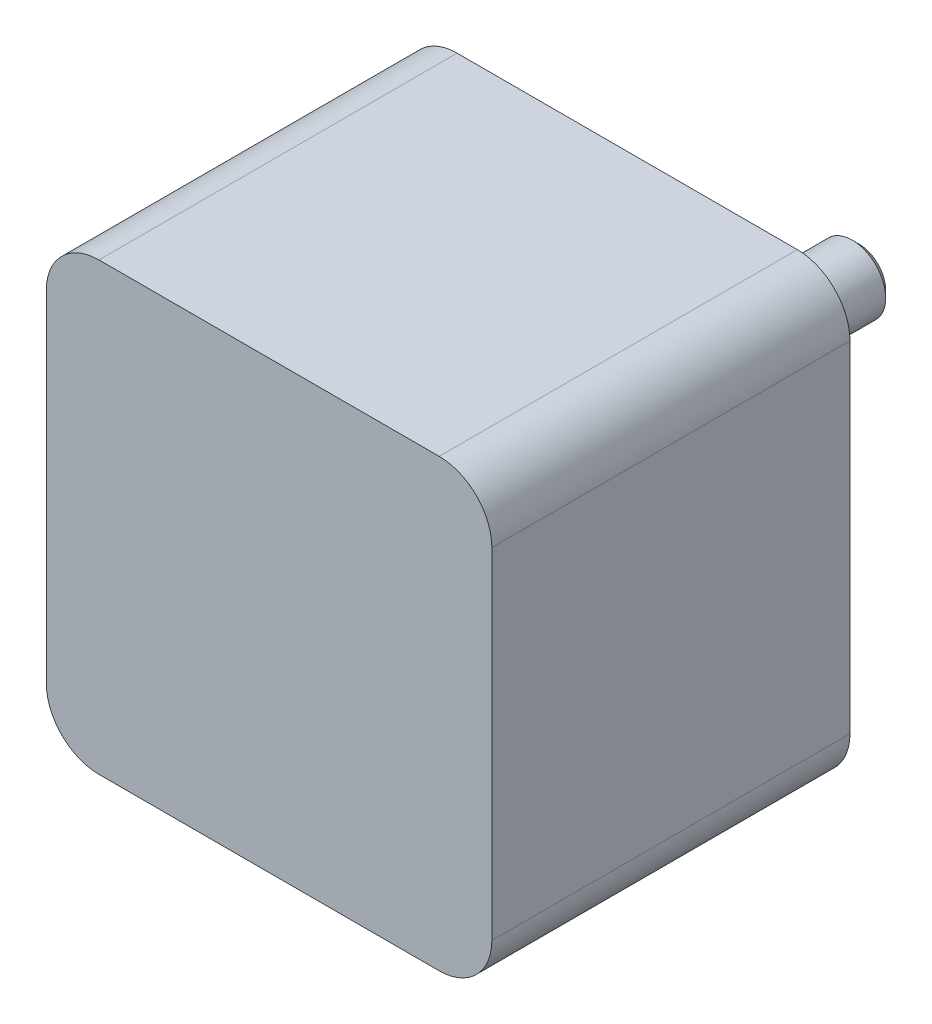
ISO-10303-21;
HEADER;
FILE_DESCRIPTION(('STEP AP214'),'2;1');
FILE_NAME('part.step','',(''),(''),'','','');
FILE_SCHEMA(('AUTOMOTIVE_DESIGN { 1 0 10303 214 1 1 1 1 }'));
ENDSEC;
DATA;
#1=APPLICATION_CONTEXT('core data for automotive mechanical design processes');
#2=APPLICATION_PROTOCOL_DEFINITION('international standard','automotive_design',2000,#1);
#3=PRODUCT_CONTEXT('',#1,'mechanical');
#4=PRODUCT('Part','Part','',(#3));
#5=PRODUCT_RELATED_PRODUCT_CATEGORY('part','',(#4));
#6=PRODUCT_DEFINITION_FORMATION('','',#4);
#7=PRODUCT_DEFINITION_CONTEXT('part definition',#1,'design');
#8=PRODUCT_DEFINITION('design','',#6,#7);
#9=PRODUCT_DEFINITION_SHAPE('','',#8);
#10=(LENGTH_UNIT() NAMED_UNIT(*) SI_UNIT(.MILLI.,.METRE.));
#11=(NAMED_UNIT(*) PLANE_ANGLE_UNIT() SI_UNIT($,.RADIAN.));
#12=(NAMED_UNIT(*) SI_UNIT($,.STERADIAN.) SOLID_ANGLE_UNIT());
#13=UNCERTAINTY_MEASURE_WITH_UNIT(LENGTH_MEASURE(1.E-05),#10,'distance_accuracy_value','');
#14=(GEOMETRIC_REPRESENTATION_CONTEXT(3) GLOBAL_UNCERTAINTY_ASSIGNED_CONTEXT((#13)) GLOBAL_UNIT_ASSIGNED_CONTEXT((#10,
#11,#12)) REPRESENTATION_CONTEXT('',''));
#15=CARTESIAN_POINT('',(0.,0.,0.));
#16=DIRECTION('',(0.,0.,1.));
#17=DIRECTION('',(1.,0.,0.));
#18=AXIS2_PLACEMENT_3D('',#15,#16,#17);
#19=CARTESIAN_POINT('',(0.,0.,-2.));
#20=DIRECTION('',(0.,0.,-1.));
#21=DIRECTION('',(-1.,0.,0.));
#22=AXIS2_PLACEMENT_3D('',#19,#20,#21);
#23=PLANE('',#22);
#24=CARTESIAN_POINT('',(0.,0.,-2.));
#25=DIRECTION('',(0.,0.,-1.));
#26=DIRECTION('',(-1.,0.,0.));
#27=AXIS2_PLACEMENT_3D('',#24,#25,#26);
#28=CIRCLE('',#27,11.);
#29=CARTESIAN_POINT('',(-11.,0.,-2.));
#30=VERTEX_POINT('',#29);
#31=EDGE_CURVE('E124',#30,#30,#28,.T.);
#32=ORIENTED_EDGE('',*,*,#31,.T.);
#33=EDGE_LOOP('',(#32));
#34=FACE_BOUND('',#33,.T.);
#35=CARTESIAN_POINT('',(0.,0.,-2.));
#36=DIRECTION('',(0.,0.,-1.));
#37=DIRECTION('',(-1.,0.,0.));
#38=AXIS2_PLACEMENT_3D('',#35,#36,#37);
#39=CIRCLE('',#38,3.175);
#40=CARTESIAN_POINT('',(-3.175,0.,-2.));
#41=VERTEX_POINT('',#40);
#42=EDGE_CURVE('E290',#41,#41,#39,.T.);
#43=ORIENTED_EDGE('',*,*,#42,.F.);
#44=EDGE_LOOP('',(#43));
#45=FACE_BOUND('',#44,.T.);
#46=ADVANCED_FACE('F31',(#34,#45),#23,.T.);
#47=CARTESIAN_POINT('',(-16.15,-16.15,0.));
#48=DIRECTION('',(0.,0.,-1.));
#49=DIRECTION('',(-1.,0.,0.));
#50=AXIS2_PLACEMENT_3D('',#47,#48,#49);
#51=PLANE('',#50);
#52=CARTESIAN_POINT('',(-15.4999999999997,-15.5000000000002,0.));
#53=DIRECTION('',(0.,0.,1.));
#54=DIRECTION('',(1.,0.,0.));
#55=AXIS2_PLACEMENT_3D('',#52,#53,#54);
#56=CIRCLE('',#55,1.5875);
#57=CARTESIAN_POINT('',(-13.9124999999997,-15.5000000000002,0.));
#58=VERTEX_POINT('',#57);
#59=EDGE_CURVE('E156',#58,#58,#56,.T.);
#60=ORIENTED_EDGE('',*,*,#59,.T.);
#61=EDGE_LOOP('',(#60));
#62=FACE_BOUND('',#61,.T.);
#63=CARTESIAN_POINT('',(-15.5,15.4999999999998,0.));
#64=DIRECTION('',(0.,0.,1.));
#65=DIRECTION('',(1.,0.,0.));
#66=AXIS2_PLACEMENT_3D('',#63,#64,#65);
#67=CIRCLE('',#66,1.5875);
#68=CARTESIAN_POINT('',(-13.9125,15.4999999999998,0.));
#69=VERTEX_POINT('',#68);
#70=EDGE_CURVE('E162',#69,#69,#67,.T.);
#71=ORIENTED_EDGE('',*,*,#70,.T.);
#72=EDGE_LOOP('',(#71));
#73=FACE_BOUND('',#72,.T.);
#74=CARTESIAN_POINT('',(-16.15,-16.15,0.));
#75=DIRECTION('',(0.,0.,1.));
#76=DIRECTION('',(-1.,0.,0.));
#77=AXIS2_PLACEMENT_3D('',#74,#75,#76);
#78=CIRCLE('',#77,5.);
#79=CARTESIAN_POINT('',(-21.15,-16.15,0.));
#80=VERTEX_POINT('',#79);
#81=CARTESIAN_POINT('',(-16.15,-21.15,0.));
#82=VERTEX_POINT('',#81);
#83=EDGE_CURVE('E168',#80,#82,#78,.T.);
#84=ORIENTED_EDGE('',*,*,#83,.F.);
#85=DIRECTION('',(0.,-1.,0.));
#86=VECTOR('',#85,1.);
#87=CARTESIAN_POINT('',(-21.15,-16.15,0.));
#88=LINE('',#87,#86);
#89=CARTESIAN_POINT('',(-21.15,16.15,0.));
#90=VERTEX_POINT('',#89);
#91=EDGE_CURVE('E46',#90,#80,#88,.T.);
#92=ORIENTED_EDGE('',*,*,#91,.F.);
#93=CARTESIAN_POINT('',(-16.15,16.15,0.));
#94=DIRECTION('',(0.,0.,1.));
#95=DIRECTION('',(-1.,0.,0.));
#96=AXIS2_PLACEMENT_3D('',#93,#94,#95);
#97=CIRCLE('',#96,5.);
#98=CARTESIAN_POINT('',(-16.15,21.15,0.));
#99=VERTEX_POINT('',#98);
#100=EDGE_CURVE('E54',#99,#90,#97,.T.);
#101=ORIENTED_EDGE('',*,*,#100,.F.);
#102=DIRECTION('',(-1.,0.,0.));
#103=VECTOR('',#102,1.);
#104=CARTESIAN_POINT('',(-16.15,21.15,0.));
#105=LINE('',#104,#103);
#106=CARTESIAN_POINT('',(16.15,21.15,0.));
#107=VERTEX_POINT('',#106);
#108=EDGE_CURVE('E178',#107,#99,#105,.T.);
#109=ORIENTED_EDGE('',*,*,#108,.F.);
#110=CARTESIAN_POINT('',(16.15,16.15,0.));
#111=DIRECTION('',(0.,0.,1.));
#112=DIRECTION('',(-1.,0.,0.));
#113=AXIS2_PLACEMENT_3D('',#110,#111,#112);
#114=CIRCLE('',#113,5.);
#115=CARTESIAN_POINT('',(21.15,16.15,0.));
#116=VERTEX_POINT('',#115);
#117=EDGE_CURVE('E176',#116,#107,#114,.T.);
#118=ORIENTED_EDGE('',*,*,#117,.F.);
#119=DIRECTION('',(0.,1.,0.));
#120=VECTOR('',#119,1.);
#121=CARTESIAN_POINT('',(21.15,-16.15,0.));
#122=LINE('',#121,#120);
#123=CARTESIAN_POINT('',(21.15,-16.15,0.));
#124=VERTEX_POINT('',#123);
#125=EDGE_CURVE('E174',#124,#116,#122,.T.);
#126=ORIENTED_EDGE('',*,*,#125,.F.);
#127=CARTESIAN_POINT('',(16.15,-16.15,0.));
#128=DIRECTION('',(0.,0.,1.));
#129=DIRECTION('',(1.,0.,0.));
#130=AXIS2_PLACEMENT_3D('',#127,#128,#129);
#131=CIRCLE('',#130,5.);
#132=CARTESIAN_POINT('',(16.15,-21.15,0.));
#133=VERTEX_POINT('',#132);
#134=EDGE_CURVE('E104',#133,#124,#131,.T.);
#135=ORIENTED_EDGE('',*,*,#134,.F.);
#136=DIRECTION('',(1.,0.,0.));
#137=VECTOR('',#136,1.);
#138=CARTESIAN_POINT('',(-16.15,-21.15,0.));
#139=LINE('',#138,#137);
#140=EDGE_CURVE('E171',#82,#133,#139,.T.);
#141=ORIENTED_EDGE('',*,*,#140,.F.);
#142=EDGE_LOOP('',(#84,#92,#101,#109,#118,#126,#135,#141));
#143=FACE_BOUND('',#142,.T.);
#144=CARTESIAN_POINT('',(15.5,15.5,0.));
#145=DIRECTION('',(0.,0.,1.));
#146=DIRECTION('',(1.,0.,0.));
#147=AXIS2_PLACEMENT_3D('',#144,#145,#146);
#148=CIRCLE('',#147,1.5875);
#149=CARTESIAN_POINT('',(17.0875,15.5,0.));
#150=VERTEX_POINT('',#149);
#151=EDGE_CURVE('E165',#150,#150,#148,.T.);
#152=ORIENTED_EDGE('',*,*,#151,.T.);
#153=EDGE_LOOP('',(#152));
#154=FACE_BOUND('',#153,.T.);
#155=CARTESIAN_POINT('',(15.5000000000003,-15.5,0.));
#156=DIRECTION('',(0.,0.,1.));
#157=DIRECTION('',(1.,0.,0.));
#158=AXIS2_PLACEMENT_3D('',#155,#156,#157);
#159=CIRCLE('',#158,1.5875);
#160=CARTESIAN_POINT('',(17.0875000000003,-15.5,0.));
#161=VERTEX_POINT('',#160);
#162=EDGE_CURVE('E159',#161,#161,#159,.T.);
#163=ORIENTED_EDGE('',*,*,#162,.T.);
#164=EDGE_LOOP('',(#163));
#165=FACE_BOUND('',#164,.T.);
#166=CARTESIAN_POINT('',(0.,0.,0.));
#167=DIRECTION('',(0.,0.,-1.));
#168=DIRECTION('',(-1.,0.,0.));
#169=AXIS2_PLACEMENT_3D('',#166,#167,#168);
#170=CIRCLE('',#169,11.);
#171=CARTESIAN_POINT('',(-11.,0.,0.));
#172=VERTEX_POINT('',#171);
#173=EDGE_CURVE('E127',#172,#172,#170,.T.);
#174=ORIENTED_EDGE('',*,*,#173,.F.);
#175=EDGE_LOOP('',(#174));
#176=FACE_BOUND('',#175,.T.);
#177=ADVANCED_FACE('F209',(#62,#73,#143,#154,#165,#176),#51,.T.);
#178=CARTESIAN_POINT('',(-16.15,-16.15,32.));
#179=DIRECTION('',(0.,0.,-1.));
#180=DIRECTION('',(-1.,0.,0.));
#181=AXIS2_PLACEMENT_3D('',#178,#179,#180);
#182=CYLINDRICAL_SURFACE('',#181,5.);
#183=ORIENTED_EDGE('',*,*,#83,.T.);
#184=DIRECTION('',(0.,0.,-1.));
#185=VECTOR('',#184,1.);
#186=CARTESIAN_POINT('',(-16.15,-21.15,32.));
#187=LINE('',#186,#185);
#188=CARTESIAN_POINT('',(-16.15,-21.15,34.));
#189=VERTEX_POINT('',#188);
#190=EDGE_CURVE('E193',#189,#82,#187,.T.);
#191=ORIENTED_EDGE('',*,*,#190,.F.);
#192=CARTESIAN_POINT('',(-16.15,-16.15,34.));
#193=DIRECTION('',(0.,0.,1.));
#194=DIRECTION('',(-1.,0.,0.));
#195=AXIS2_PLACEMENT_3D('',#192,#193,#194);
#196=CIRCLE('',#195,5.);
#197=CARTESIAN_POINT('',(-21.15,-16.15,34.));
#198=VERTEX_POINT('',#197);
#199=EDGE_CURVE('E141',#198,#189,#196,.T.);
#200=ORIENTED_EDGE('',*,*,#199,.F.);
#201=DIRECTION('',(0.,0.,-1.));
#202=VECTOR('',#201,1.);
#203=CARTESIAN_POINT('',(-21.15,-16.15,32.));
#204=LINE('',#203,#202);
#205=EDGE_CURVE('E182',#198,#80,#204,.T.);
#206=ORIENTED_EDGE('',*,*,#205,.T.);
#207=EDGE_LOOP('',(#183,#191,#200,#206));
#208=FACE_BOUND('',#207,.T.);
#209=ADVANCED_FACE('F215',(#208),#182,.T.);
#210=CARTESIAN_POINT('',(-16.15,-21.15,32.));
#211=DIRECTION('',(0.,1.,0.));
#212=DIRECTION('',(0.,0.,1.));
#213=AXIS2_PLACEMENT_3D('',#210,#211,#212);
#214=PLANE('',#213);
#215=ORIENTED_EDGE('',*,*,#140,.T.);
#216=DIRECTION('',(0.,0.,-1.));
#217=VECTOR('',#216,1.);
#218=CARTESIAN_POINT('',(16.15,-21.15,32.));
#219=LINE('',#218,#217);
#220=CARTESIAN_POINT('',(16.15,-21.15,34.));
#221=VERTEX_POINT('',#220);
#222=EDGE_CURVE('E107',#221,#133,#219,.T.);
#223=ORIENTED_EDGE('',*,*,#222,.F.);
#224=DIRECTION('',(1.,0.,0.));
#225=VECTOR('',#224,1.);
#226=CARTESIAN_POINT('',(-16.15,-21.15,34.));
#227=LINE('',#226,#225);
#228=EDGE_CURVE('E123',#189,#221,#227,.T.);
#229=ORIENTED_EDGE('',*,*,#228,.F.);
#230=ORIENTED_EDGE('',*,*,#190,.T.);
#231=EDGE_LOOP('',(#215,#223,#229,#230));
#232=FACE_BOUND('',#231,.T.);
#233=ADVANCED_FACE('F267',(#232),#214,.F.);
#234=CARTESIAN_POINT('',(16.15,-16.15,32.));
#235=DIRECTION('',(0.,0.,-1.));
#236=DIRECTION('',(-1.,0.,0.));
#237=AXIS2_PLACEMENT_3D('',#234,#235,#236);
#238=CYLINDRICAL_SURFACE('',#237,5.);
#239=ORIENTED_EDGE('',*,*,#134,.T.);
#240=DIRECTION('',(0.,0.,-1.));
#241=VECTOR('',#240,1.);
#242=CARTESIAN_POINT('',(21.15,-16.15,32.));
#243=LINE('',#242,#241);
#244=CARTESIAN_POINT('',(21.15,-16.15,34.));
#245=VERTEX_POINT('',#244);
#246=EDGE_CURVE('E97',#245,#124,#243,.T.);
#247=ORIENTED_EDGE('',*,*,#246,.F.);
#248=CARTESIAN_POINT('',(16.15,-16.15,34.));
#249=DIRECTION('',(0.,0.,1.));
#250=DIRECTION('',(1.,0.,0.));
#251=AXIS2_PLACEMENT_3D('',#248,#249,#250);
#252=CIRCLE('',#251,5.);
#253=EDGE_CURVE('E102',#221,#245,#252,.T.);
#254=ORIENTED_EDGE('',*,*,#253,.F.);
#255=ORIENTED_EDGE('',*,*,#222,.T.);
#256=EDGE_LOOP('',(#239,#247,#254,#255));
#257=FACE_BOUND('',#256,.T.);
#258=ADVANCED_FACE('F99',(#257),#238,.T.);
#259=CARTESIAN_POINT('',(21.15,-16.15,32.));
#260=DIRECTION('',(-1.,0.,0.));
#261=DIRECTION('',(0.,0.,1.));
#262=AXIS2_PLACEMENT_3D('',#259,#260,#261);
#263=PLANE('',#262);
#264=ORIENTED_EDGE('',*,*,#125,.T.);
#265=DIRECTION('',(0.,0.,-1.));
#266=VECTOR('',#265,1.);
#267=CARTESIAN_POINT('',(21.15,16.15,32.));
#268=LINE('',#267,#266);
#269=CARTESIAN_POINT('',(21.15,16.15,34.));
#270=VERTEX_POINT('',#269);
#271=EDGE_CURVE('E108',#270,#116,#268,.T.);
#272=ORIENTED_EDGE('',*,*,#271,.F.);
#273=DIRECTION('',(0.,1.,0.));
#274=VECTOR('',#273,1.);
#275=CARTESIAN_POINT('',(21.15,-16.15,34.));
#276=LINE('',#275,#274);
#277=EDGE_CURVE('E111',#245,#270,#276,.T.);
#278=ORIENTED_EDGE('',*,*,#277,.F.);
#279=ORIENTED_EDGE('',*,*,#246,.T.);
#280=EDGE_LOOP('',(#264,#272,#278,#279));
#281=FACE_BOUND('',#280,.T.);
#282=ADVANCED_FACE('F112',(#281),#263,.F.);
#283=CARTESIAN_POINT('',(16.15,16.15,32.));
#284=DIRECTION('',(0.,0.,-1.));
#285=DIRECTION('',(-1.,0.,0.));
#286=AXIS2_PLACEMENT_3D('',#283,#284,#285);
#287=CYLINDRICAL_SURFACE('',#286,5.);
#288=ORIENTED_EDGE('',*,*,#117,.T.);
#289=DIRECTION('',(0.,0.,-1.));
#290=VECTOR('',#289,1.);
#291=CARTESIAN_POINT('',(16.15,21.15,32.));
#292=LINE('',#291,#290);
#293=CARTESIAN_POINT('',(16.15,21.15,34.));
#294=VERTEX_POINT('',#293);
#295=EDGE_CURVE('E188',#294,#107,#292,.T.);
#296=ORIENTED_EDGE('',*,*,#295,.F.);
#297=CARTESIAN_POINT('',(16.15,16.15,34.));
#298=DIRECTION('',(0.,0.,1.));
#299=DIRECTION('',(-1.,0.,0.));
#300=AXIS2_PLACEMENT_3D('',#297,#298,#299);
#301=CIRCLE('',#300,5.);
#302=EDGE_CURVE('E117',#270,#294,#301,.T.);
#303=ORIENTED_EDGE('',*,*,#302,.F.);
#304=ORIENTED_EDGE('',*,*,#271,.T.);
#305=EDGE_LOOP('',(#288,#296,#303,#304));
#306=FACE_BOUND('',#305,.T.);
#307=ADVANCED_FACE('F258',(#306),#287,.T.);
#308=CARTESIAN_POINT('',(-16.15,21.15,32.));
#309=DIRECTION('',(0.,-1.,0.));
#310=DIRECTION('',(0.,0.,-1.));
#311=AXIS2_PLACEMENT_3D('',#308,#309,#310);
#312=PLANE('',#311);
#313=ORIENTED_EDGE('',*,*,#108,.T.);
#314=DIRECTION('',(0.,0.,-1.));
#315=VECTOR('',#314,1.);
#316=CARTESIAN_POINT('',(-16.15,21.15,32.));
#317=LINE('',#316,#315);
#318=CARTESIAN_POINT('',(-16.15,21.15,34.));
#319=VERTEX_POINT('',#318);
#320=EDGE_CURVE('E186',#319,#99,#317,.T.);
#321=ORIENTED_EDGE('',*,*,#320,.F.);
#322=DIRECTION('',(-1.,0.,0.));
#323=VECTOR('',#322,1.);
#324=CARTESIAN_POINT('',(-16.15,21.15,34.));
#325=LINE('',#324,#323);
#326=EDGE_CURVE('E132',#294,#319,#325,.T.);
#327=ORIENTED_EDGE('',*,*,#326,.F.);
#328=ORIENTED_EDGE('',*,*,#295,.T.);
#329=EDGE_LOOP('',(#313,#321,#327,#328));
#330=FACE_BOUND('',#329,.T.);
#331=ADVANCED_FACE('F255',(#330),#312,.F.);
#332=CARTESIAN_POINT('',(-16.15,16.15,32.));
#333=DIRECTION('',(0.,0.,-1.));
#334=DIRECTION('',(-1.,0.,0.));
#335=AXIS2_PLACEMENT_3D('',#332,#333,#334);
#336=CYLINDRICAL_SURFACE('',#335,5.);
#337=ORIENTED_EDGE('',*,*,#100,.T.);
#338=DIRECTION('',(0.,0.,-1.));
#339=VECTOR('',#338,1.);
#340=CARTESIAN_POINT('',(-21.15,16.15,32.));
#341=LINE('',#340,#339);
#342=CARTESIAN_POINT('',(-21.15,16.15,34.));
#343=VERTEX_POINT('',#342);
#344=EDGE_CURVE('E184',#343,#90,#341,.T.);
#345=ORIENTED_EDGE('',*,*,#344,.F.);
#346=CARTESIAN_POINT('',(-16.15,16.15,34.));
#347=DIRECTION('',(0.,0.,1.));
#348=DIRECTION('',(-1.,0.,0.));
#349=AXIS2_PLACEMENT_3D('',#346,#347,#348);
#350=CIRCLE('',#349,5.);
#351=EDGE_CURVE('E135',#319,#343,#350,.T.);
#352=ORIENTED_EDGE('',*,*,#351,.F.);
#353=ORIENTED_EDGE('',*,*,#320,.T.);
#354=EDGE_LOOP('',(#337,#345,#352,#353));
#355=FACE_BOUND('',#354,.T.);
#356=ADVANCED_FACE('F252',(#355),#336,.T.);
#357=CARTESIAN_POINT('',(-21.15,-16.15,32.));
#358=DIRECTION('',(1.,0.,0.));
#359=DIRECTION('',(0.,0.,-1.));
#360=AXIS2_PLACEMENT_3D('',#357,#358,#359);
#361=PLANE('',#360);
#362=ORIENTED_EDGE('',*,*,#91,.T.);
#363=ORIENTED_EDGE('',*,*,#205,.F.);
#364=DIRECTION('',(0.,-1.,0.));
#365=VECTOR('',#364,1.);
#366=CARTESIAN_POINT('',(-21.15,-16.15,34.));
#367=LINE('',#366,#365);
#368=EDGE_CURVE('E138',#343,#198,#367,.T.);
#369=ORIENTED_EDGE('',*,*,#368,.F.);
#370=ORIENTED_EDGE('',*,*,#344,.T.);
#371=EDGE_LOOP('',(#362,#363,#369,#370));
#372=FACE_BOUND('',#371,.T.);
#373=ADVANCED_FACE('F247',(#372),#361,.F.);
#374=CARTESIAN_POINT('',(15.5,15.5,32.));
#375=DIRECTION('',(0.,0.,-1.));
#376=DIRECTION('',(-1.,0.,0.));
#377=AXIS2_PLACEMENT_3D('',#374,#375,#376);
#378=CYLINDRICAL_SURFACE('',#377,1.5875);
#379=CARTESIAN_POINT('',(15.5,15.5,32.));
#380=DIRECTION('',(0.,0.,1.));
#381=DIRECTION('',(1.,0.,0.));
#382=AXIS2_PLACEMENT_3D('',#379,#380,#381);
#383=CIRCLE('',#382,1.5875);
#384=CARTESIAN_POINT('',(17.0875,15.5,32.));
#385=VERTEX_POINT('',#384);
#386=EDGE_CURVE('E153',#385,#385,#383,.T.);
#387=ORIENTED_EDGE('',*,*,#386,.T.);
#388=EDGE_LOOP('',(#387));
#389=FACE_BOUND('',#388,.T.);
#390=ORIENTED_EDGE('',*,*,#151,.F.);
#391=EDGE_LOOP('',(#390));
#392=FACE_BOUND('',#391,.T.);
#393=ADVANCED_FACE('F244',(#389,#392),#378,.F.);
#394=CARTESIAN_POINT('',(-15.5,15.4999999999998,32.));
#395=DIRECTION('',(0.,0.,-1.));
#396=DIRECTION('',(-1.,0.,0.));
#397=AXIS2_PLACEMENT_3D('',#394,#395,#396);
#398=CYLINDRICAL_SURFACE('',#397,1.5875);
#399=CARTESIAN_POINT('',(-15.5,15.4999999999998,32.));
#400=DIRECTION('',(0.,0.,1.));
#401=DIRECTION('',(1.,0.,0.));
#402=AXIS2_PLACEMENT_3D('',#399,#400,#401);
#403=CIRCLE('',#402,1.5875);
#404=CARTESIAN_POINT('',(-13.9125,15.4999999999998,32.));
#405=VERTEX_POINT('',#404);
#406=EDGE_CURVE('E150',#405,#405,#403,.T.);
#407=ORIENTED_EDGE('',*,*,#406,.T.);
#408=EDGE_LOOP('',(#407));
#409=FACE_BOUND('',#408,.T.);
#410=ORIENTED_EDGE('',*,*,#70,.F.);
#411=EDGE_LOOP('',(#410));
#412=FACE_BOUND('',#411,.T.);
#413=ADVANCED_FACE('F240',(#409,#412),#398,.F.);
#414=CARTESIAN_POINT('',(15.5000000000003,-15.5,32.));
#415=DIRECTION('',(0.,0.,-1.));
#416=DIRECTION('',(-1.,0.,0.));
#417=AXIS2_PLACEMENT_3D('',#414,#415,#416);
#418=CYLINDRICAL_SURFACE('',#417,1.5875);
#419=CARTESIAN_POINT('',(15.5000000000003,-15.5,32.));
#420=DIRECTION('',(0.,0.,1.));
#421=DIRECTION('',(1.,0.,0.));
#422=AXIS2_PLACEMENT_3D('',#419,#420,#421);
#423=CIRCLE('',#422,1.5875);
#424=CARTESIAN_POINT('',(17.0875000000003,-15.5,32.));
#425=VERTEX_POINT('',#424);
#426=EDGE_CURVE('E147',#425,#425,#423,.T.);
#427=ORIENTED_EDGE('',*,*,#426,.T.);
#428=EDGE_LOOP('',(#427));
#429=FACE_BOUND('',#428,.T.);
#430=ORIENTED_EDGE('',*,*,#162,.F.);
#431=EDGE_LOOP('',(#430));
#432=FACE_BOUND('',#431,.T.);
#433=ADVANCED_FACE('F236',(#429,#432),#418,.F.);
#434=CARTESIAN_POINT('',(-15.4999999999997,-15.5000000000002,32.));
#435=DIRECTION('',(0.,0.,-1.));
#436=DIRECTION('',(-1.,0.,0.));
#437=AXIS2_PLACEMENT_3D('',#434,#435,#436);
#438=CYLINDRICAL_SURFACE('',#437,1.5875);
#439=CARTESIAN_POINT('',(-15.4999999999997,-15.5000000000002,32.));
#440=DIRECTION('',(0.,0.,1.));
#441=DIRECTION('',(1.,0.,0.));
#442=AXIS2_PLACEMENT_3D('',#439,#440,#441);
#443=CIRCLE('',#442,1.5875);
#444=CARTESIAN_POINT('',(-13.9124999999997,-15.5000000000002,32.));
#445=VERTEX_POINT('',#444);
#446=EDGE_CURVE('E144',#445,#445,#443,.T.);
#447=ORIENTED_EDGE('',*,*,#446,.T.);
#448=EDGE_LOOP('',(#447));
#449=FACE_BOUND('',#448,.T.);
#450=ORIENTED_EDGE('',*,*,#59,.F.);
#451=EDGE_LOOP('',(#450));
#452=FACE_BOUND('',#451,.T.);
#453=ADVANCED_FACE('F232',(#449,#452),#438,.F.);
#454=CARTESIAN_POINT('',(16.15,-16.15,32.));
#455=DIRECTION('',(0.,0.,1.));
#456=DIRECTION('',(1.,0.,0.));
#457=AXIS2_PLACEMENT_3D('',#454,#455,#456);
#458=PLANE('',#457);
#459=ORIENTED_EDGE('',*,*,#446,.F.);
#460=EDGE_LOOP('',(#459));
#461=FACE_BOUND('',#460,.T.);
#462=ADVANCED_FACE('F228',(#461),#458,.F.);
#463=ORIENTED_EDGE('',*,*,#426,.F.);
#464=EDGE_LOOP('',(#463));
#465=FACE_BOUND('',#464,.T.);
#466=ADVANCED_FACE('F231',(#465),#458,.F.);
#467=ORIENTED_EDGE('',*,*,#406,.F.);
#468=EDGE_LOOP('',(#467));
#469=FACE_BOUND('',#468,.T.);
#470=ADVANCED_FACE('F339',(#469),#458,.F.);
#471=ORIENTED_EDGE('',*,*,#386,.F.);
#472=EDGE_LOOP('',(#471));
#473=FACE_BOUND('',#472,.T.);
#474=ADVANCED_FACE('F227',(#473),#458,.F.);
#475=CARTESIAN_POINT('',(16.15,-16.15,34.));
#476=DIRECTION('',(0.,0.,1.));
#477=DIRECTION('',(1.,0.,0.));
#478=AXIS2_PLACEMENT_3D('',#475,#476,#477);
#479=PLANE('',#478);
#480=ORIENTED_EDGE('',*,*,#253,.T.);
#481=ORIENTED_EDGE('',*,*,#277,.T.);
#482=ORIENTED_EDGE('',*,*,#302,.T.);
#483=ORIENTED_EDGE('',*,*,#326,.T.);
#484=ORIENTED_EDGE('',*,*,#351,.T.);
#485=ORIENTED_EDGE('',*,*,#368,.T.);
#486=ORIENTED_EDGE('',*,*,#199,.T.);
#487=ORIENTED_EDGE('',*,*,#228,.T.);
#488=EDGE_LOOP('',(#480,#481,#482,#483,#484,#485,#486,#487));
#489=FACE_BOUND('',#488,.T.);
#490=ADVANCED_FACE('F120',(#489),#479,.T.);
#491=CARTESIAN_POINT('',(0.,0.,-2.));
#492=DIRECTION('',(0.,0.,1.));
#493=DIRECTION('',(1.,0.,0.));
#494=AXIS2_PLACEMENT_3D('',#491,#492,#493);
#495=CYLINDRICAL_SURFACE('',#494,11.);
#496=ORIENTED_EDGE('',*,*,#31,.F.);
#497=EDGE_LOOP('',(#496));
#498=FACE_BOUND('',#497,.T.);
#499=ORIENTED_EDGE('',*,*,#173,.T.);
#500=EDGE_LOOP('',(#499));
#501=FACE_BOUND('',#500,.T.);
#502=ADVANCED_FACE('F221',(#498,#501),#495,.T.);
#503=CARTESIAN_POINT('',(0.,0.,-22.));
#504=DIRECTION('',(0.,0.,1.));
#505=DIRECTION('',(1.,0.,0.));
#506=AXIS2_PLACEMENT_3D('',#503,#504,#505);
#507=CYLINDRICAL_SURFACE('',#506,3.175);
#508=CARTESIAN_POINT('',(0.,0.,-21.365));
#509=DIRECTION('',(0.,0.,-1.));
#510=DIRECTION('',(-1.,0.,0.));
#511=AXIS2_PLACEMENT_3D('',#508,#509,#510);
#512=CIRCLE('',#511,3.175);
#513=CARTESIAN_POINT('',(-3.175,0.,-21.365));
#514=VERTEX_POINT('',#513);
#515=EDGE_CURVE('E11',#514,#514,#512,.F.);
#516=ORIENTED_EDGE('',*,*,#515,.T.);
#517=EDGE_LOOP('',(#516));
#518=FACE_BOUND('',#517,.T.);
#519=ORIENTED_EDGE('',*,*,#42,.T.);
#520=EDGE_LOOP('',(#519));
#521=FACE_BOUND('',#520,.T.);
#522=ADVANCED_FACE('F205',(#518,#521),#507,.T.);
#523=CARTESIAN_POINT('',(0.,0.,-22.));
#524=DIRECTION('',(0.,0.,-1.));
#525=DIRECTION('',(-1.,0.,0.));
#526=AXIS2_PLACEMENT_3D('',#523,#524,#525);
#527=PLANE('',#526);
#528=CARTESIAN_POINT('',(0.,0.,-22.));
#529=DIRECTION('',(0.,0.,-1.));
#530=DIRECTION('',(-1.,0.,0.));
#531=AXIS2_PLACEMENT_3D('',#528,#529,#530);
#532=CIRCLE('',#531,2.54000000000001);
#533=CARTESIAN_POINT('',(-2.54000000000001,0.,-22.));
#534=VERTEX_POINT('',#533);
#535=EDGE_CURVE('E39',#534,#534,#532,.T.);
#536=ORIENTED_EDGE('',*,*,#535,.T.);
#537=EDGE_LOOP('',(#536));
#538=FACE_BOUND('',#537,.T.);
#539=ADVANCED_FACE('F198',(#538),#527,.T.);
#540=CARTESIAN_POINT('',(0.,0.,-22.));
#541=DIRECTION('',(0.,0.,1.));
#542=DIRECTION('',(1.,0.,0.));
#543=AXIS2_PLACEMENT_3D('',#540,#541,#542);
#544=CONICAL_SURFACE('',#543,2.54000000000001,0.785398163397445);
#545=ORIENTED_EDGE('',*,*,#515,.F.);
#546=EDGE_LOOP('',(#545));
#547=FACE_BOUND('',#546,.T.);
#548=ORIENTED_EDGE('',*,*,#535,.F.);
#549=EDGE_LOOP('',(#548));
#550=FACE_BOUND('',#549,.T.);
#551=ADVANCED_FACE('F33',(#547,#550),#544,.T.);
#552=CLOSED_SHELL('',(#46,#177,#209,#233,#258,#282,#307,#331,#356,#373,#393,#413,#433,#453,#462,
#466,#470,#474,#490,#502,#522,#539,#551));
#553=MANIFOLD_SOLID_BREP('B2',#552);
#554=ADVANCED_BREP_SHAPE_REPRESENTATION('',(#18,#553),#14);
#555=SHAPE_DEFINITION_REPRESENTATION(#9,#554);
ENDSEC;
END-ISO-10303-21;
